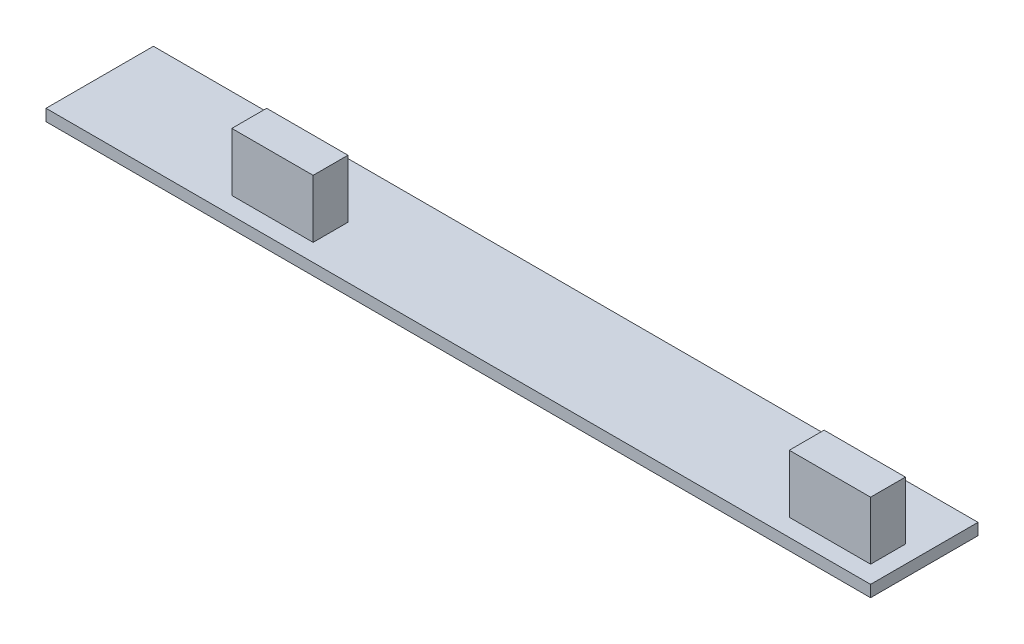
ISO-10303-21;
HEADER;
FILE_DESCRIPTION(('STEP AP214'),'2;1');
FILE_NAME('part.step','',(''),(''),'','','');
FILE_SCHEMA(('AUTOMOTIVE_DESIGN { 1 0 10303 214 1 1 1 1 }'));
ENDSEC;
DATA;
#1=APPLICATION_CONTEXT('core data for automotive mechanical design processes');
#2=APPLICATION_PROTOCOL_DEFINITION('international standard','automotive_design',2000,#1);
#3=PRODUCT_CONTEXT('',#1,'mechanical');
#4=PRODUCT('Part','Part','',(#3));
#5=PRODUCT_RELATED_PRODUCT_CATEGORY('part','',(#4));
#6=PRODUCT_DEFINITION_FORMATION('','',#4);
#7=PRODUCT_DEFINITION_CONTEXT('part definition',#1,'design');
#8=PRODUCT_DEFINITION('design','',#6,#7);
#9=PRODUCT_DEFINITION_SHAPE('','',#8);
#10=(LENGTH_UNIT() NAMED_UNIT(*) SI_UNIT(.MILLI.,.METRE.));
#11=(NAMED_UNIT(*) PLANE_ANGLE_UNIT() SI_UNIT($,.RADIAN.));
#12=(NAMED_UNIT(*) SI_UNIT($,.STERADIAN.) SOLID_ANGLE_UNIT());
#13=UNCERTAINTY_MEASURE_WITH_UNIT(LENGTH_MEASURE(1.E-05),#10,'distance_accuracy_value','');
#14=(GEOMETRIC_REPRESENTATION_CONTEXT(3) GLOBAL_UNCERTAINTY_ASSIGNED_CONTEXT((#13)) GLOBAL_UNIT_ASSIGNED_CONTEXT((#10,
#11,#12)) REPRESENTATION_CONTEXT('',''));
#15=CARTESIAN_POINT('',(0.,0.,0.));
#16=DIRECTION('',(0.,0.,1.));
#17=DIRECTION('',(1.,0.,0.));
#18=AXIS2_PLACEMENT_3D('',#15,#16,#17);
#19=CARTESIAN_POINT('',(259.09224857648,93.3157017452683,38.768969390047));
#20=DIRECTION('',(0.,1.,0.));
#21=DIRECTION('',(0.,0.,1.));
#22=AXIS2_PLACEMENT_3D('',#19,#20,#21);
#23=PLANE('',#22);
#24=DIRECTION('',(0.,0.,-1.));
#25=VECTOR('',#24,1.);
#26=CARTESIAN_POINT('',(320.394917120642,93.3157017452683,109.998911751353));
#27=LINE('',#26,#25);
#28=CARTESIAN_POINT('',(320.394917120642,93.3157017452683,106.998911751353));
#29=VERTEX_POINT('',#28);
#30=CARTESIAN_POINT('',(320.394917120642,93.3157017452683,109.998911751353));
#31=VERTEX_POINT('',#30);
#32=EDGE_CURVE('E103',#29,#31,#27,.F.);
#33=ORIENTED_EDGE('',*,*,#32,.F.);
#34=DIRECTION('',(-1.,0.,0.));
#35=VECTOR('',#34,1.);
#36=CARTESIAN_POINT('',(320.394917120642,93.3157017452683,106.998911751353));
#37=LINE('',#36,#35);
#38=CARTESIAN_POINT('',(313.394917120642,93.3157017452683,106.998911751353));
#39=VERTEX_POINT('',#38);
#40=EDGE_CURVE('E20',#39,#29,#37,.F.);
#41=ORIENTED_EDGE('',*,*,#40,.F.);
#42=DIRECTION('',(0.,0.,1.));
#43=VECTOR('',#42,1.);
#44=CARTESIAN_POINT('',(313.394917120642,93.3157017452683,106.998911751353));
#45=LINE('',#44,#43);
#46=CARTESIAN_POINT('',(313.394917120642,93.3157017452683,109.998911751353));
#47=VERTEX_POINT('',#46);
#48=EDGE_CURVE('E126',#47,#39,#45,.F.);
#49=ORIENTED_EDGE('',*,*,#48,.F.);
#50=DIRECTION('',(1.,0.,0.));
#51=VECTOR('',#50,1.);
#52=CARTESIAN_POINT('',(313.394917120642,93.3157017452683,109.998911751353));
#53=LINE('',#52,#51);
#54=EDGE_CURVE('E119',#31,#47,#53,.F.);
#55=ORIENTED_EDGE('',*,*,#54,.F.);
#56=EDGE_LOOP('',(#33,#41,#49,#55));
#57=FACE_BOUND('',#56,.T.);
#58=ADVANCED_FACE('F17',(#57),#23,.T.);
#59=CARTESIAN_POINT('',(211.09224857648,93.3157017452683,38.768969390047));
#60=DIRECTION('',(0.,1.,0.));
#61=DIRECTION('',(0.,0.,1.));
#62=AXIS2_PLACEMENT_3D('',#59,#60,#61);
#63=PLANE('',#62);
#64=DIRECTION('',(0.,0.,-1.));
#65=VECTOR('',#64,1.);
#66=CARTESIAN_POINT('',(272.394917120642,93.3157017452683,109.998911751353));
#67=LINE('',#66,#65);
#68=CARTESIAN_POINT('',(272.394917120642,93.3157017452683,106.998911751353));
#69=VERTEX_POINT('',#68);
#70=CARTESIAN_POINT('',(272.394917120642,93.3157017452683,109.998911751353));
#71=VERTEX_POINT('',#70);
#72=EDGE_CURVE('E139',#69,#71,#67,.F.);
#73=ORIENTED_EDGE('',*,*,#72,.F.);
#74=DIRECTION('',(-1.,0.,0.));
#75=VECTOR('',#74,1.);
#76=CARTESIAN_POINT('',(272.394917120642,93.3157017452683,106.998911751353));
#77=LINE('',#76,#75);
#78=CARTESIAN_POINT('',(265.394917120642,93.3157017452683,106.998911751353));
#79=VERTEX_POINT('',#78);
#80=EDGE_CURVE('E134',#79,#69,#77,.F.);
#81=ORIENTED_EDGE('',*,*,#80,.F.);
#82=DIRECTION('',(0.,0.,1.));
#83=VECTOR('',#82,1.);
#84=CARTESIAN_POINT('',(265.394917120642,93.3157017452683,106.998911751353));
#85=LINE('',#84,#83);
#86=CARTESIAN_POINT('',(265.394917120642,93.3157017452683,109.998911751353));
#87=VERTEX_POINT('',#86);
#88=EDGE_CURVE('E132',#87,#79,#85,.F.);
#89=ORIENTED_EDGE('',*,*,#88,.F.);
#90=DIRECTION('',(1.,0.,0.));
#91=VECTOR('',#90,1.);
#92=CARTESIAN_POINT('',(265.394917120642,93.3157017452683,109.998911751353));
#93=LINE('',#92,#91);
#94=EDGE_CURVE('E144',#71,#87,#93,.F.);
#95=ORIENTED_EDGE('',*,*,#94,.F.);
#96=EDGE_LOOP('',(#73,#81,#89,#95));
#97=FACE_BOUND('',#96,.T.);
#98=ADVANCED_FACE('F253',(#97),#63,.T.);
#99=CARTESIAN_POINT('',(320.394917120642,93.3157017452683,106.998911751353));
#100=DIRECTION('',(0.,0.,-1.));
#101=DIRECTION('',(-1.,0.,0.));
#102=AXIS2_PLACEMENT_3D('',#99,#100,#101);
#103=PLANE('',#102);
#104=DIRECTION('',(1.,0.,0.));
#105=VECTOR('',#104,1.);
#106=CARTESIAN_POINT('',(627.09224857648,88.3157017452683,106.998911751353));
#107=LINE('',#106,#105);
#108=CARTESIAN_POINT('',(313.394917120642,88.3157017452683,106.998911751353));
#109=VERTEX_POINT('',#108);
#110=CARTESIAN_POINT('',(320.394917120642,88.3157017452683,106.998911751353));
#111=VERTEX_POINT('',#110);
#112=EDGE_CURVE('E151',#109,#111,#107,.T.);
#113=ORIENTED_EDGE('',*,*,#112,.F.);
#114=DIRECTION('',(0.,1.,0.));
#115=VECTOR('',#114,1.);
#116=CARTESIAN_POINT('',(313.394917120642,93.3157017452683,106.998911751353));
#117=LINE('',#116,#115);
#118=EDGE_CURVE('E114',#39,#109,#117,.F.);
#119=ORIENTED_EDGE('',*,*,#118,.F.);
#120=ORIENTED_EDGE('',*,*,#40,.T.);
#121=DIRECTION('',(0.,1.,0.));
#122=VECTOR('',#121,1.);
#123=CARTESIAN_POINT('',(320.394917120642,93.3157017452683,106.998911751353));
#124=LINE('',#123,#122);
#125=EDGE_CURVE('E112',#111,#29,#124,.T.);
#126=ORIENTED_EDGE('',*,*,#125,.F.);
#127=EDGE_LOOP('',(#113,#119,#120,#126));
#128=FACE_BOUND('',#127,.T.);
#129=ADVANCED_FACE('F111',(#128),#103,.T.);
#130=CARTESIAN_POINT('',(320.394917120642,93.3157017452683,109.998911751353));
#131=DIRECTION('',(1.,0.,0.));
#132=DIRECTION('',(0.,0.,-1.));
#133=AXIS2_PLACEMENT_3D('',#130,#131,#132);
#134=PLANE('',#133);
#135=DIRECTION('',(0.,0.,1.));
#136=VECTOR('',#135,1.);
#137=CARTESIAN_POINT('',(320.394917120642,88.3157017452683,38.768969390047));
#138=LINE('',#137,#136);
#139=CARTESIAN_POINT('',(320.394917120642,88.3157017452683,109.998911751353));
#140=VERTEX_POINT('',#139);
#141=EDGE_CURVE('E118',#111,#140,#138,.T.);
#142=ORIENTED_EDGE('',*,*,#141,.F.);
#143=ORIENTED_EDGE('',*,*,#125,.T.);
#144=ORIENTED_EDGE('',*,*,#32,.T.);
#145=DIRECTION('',(0.,1.,0.));
#146=VECTOR('',#145,1.);
#147=CARTESIAN_POINT('',(320.394917120642,93.3157017452683,109.998911751353));
#148=LINE('',#147,#146);
#149=EDGE_CURVE('E124',#140,#31,#148,.T.);
#150=ORIENTED_EDGE('',*,*,#149,.F.);
#151=EDGE_LOOP('',(#142,#143,#144,#150));
#152=FACE_BOUND('',#151,.T.);
#153=ADVANCED_FACE('F117',(#152),#134,.T.);
#154=CARTESIAN_POINT('',(313.394917120642,93.3157017452683,109.998911751353));
#155=DIRECTION('',(0.,0.,1.));
#156=DIRECTION('',(1.,0.,0.));
#157=AXIS2_PLACEMENT_3D('',#154,#155,#156);
#158=PLANE('',#157);
#159=DIRECTION('',(1.,0.,0.));
#160=VECTOR('',#159,1.);
#161=CARTESIAN_POINT('',(627.09224857648,88.3157017452683,109.998911751353));
#162=LINE('',#161,#160);
#163=CARTESIAN_POINT('',(313.394917120642,88.3157017452683,109.998911751353));
#164=VERTEX_POINT('',#163);
#165=EDGE_CURVE('E154',#140,#164,#162,.F.);
#166=ORIENTED_EDGE('',*,*,#165,.F.);
#167=ORIENTED_EDGE('',*,*,#149,.T.);
#168=ORIENTED_EDGE('',*,*,#54,.T.);
#169=DIRECTION('',(0.,1.,0.));
#170=VECTOR('',#169,1.);
#171=CARTESIAN_POINT('',(313.394917120642,93.3157017452683,109.998911751353));
#172=LINE('',#171,#170);
#173=EDGE_CURVE('E129',#164,#47,#172,.T.);
#174=ORIENTED_EDGE('',*,*,#173,.F.);
#175=EDGE_LOOP('',(#166,#167,#168,#174));
#176=FACE_BOUND('',#175,.T.);
#177=ADVANCED_FACE('F245',(#176),#158,.T.);
#178=CARTESIAN_POINT('',(313.394917120642,93.3157017452683,106.998911751353));
#179=DIRECTION('',(-1.,0.,0.));
#180=DIRECTION('',(0.,0.,1.));
#181=AXIS2_PLACEMENT_3D('',#178,#179,#180);
#182=PLANE('',#181);
#183=DIRECTION('',(0.,0.,1.));
#184=VECTOR('',#183,1.);
#185=CARTESIAN_POINT('',(313.394917120642,88.3157017452683,38.768969390047));
#186=LINE('',#185,#184);
#187=EDGE_CURVE('E156',#164,#109,#186,.F.);
#188=ORIENTED_EDGE('',*,*,#187,.F.);
#189=ORIENTED_EDGE('',*,*,#173,.T.);
#190=ORIENTED_EDGE('',*,*,#48,.T.);
#191=ORIENTED_EDGE('',*,*,#118,.T.);
#192=EDGE_LOOP('',(#188,#189,#190,#191));
#193=FACE_BOUND('',#192,.T.);
#194=ADVANCED_FACE('F241',(#193),#182,.T.);
#195=CARTESIAN_POINT('',(265.394917120642,93.3157017452683,106.998911751353));
#196=DIRECTION('',(-1.,0.,0.));
#197=DIRECTION('',(0.,0.,1.));
#198=AXIS2_PLACEMENT_3D('',#195,#196,#197);
#199=PLANE('',#198);
#200=DIRECTION('',(0.,0.,1.));
#201=VECTOR('',#200,1.);
#202=CARTESIAN_POINT('',(265.394917120642,88.3157017452683,38.768969390047));
#203=LINE('',#202,#201);
#204=CARTESIAN_POINT('',(265.394917120642,88.3157017452683,109.998911751353));
#205=VERTEX_POINT('',#204);
#206=CARTESIAN_POINT('',(265.394917120642,88.3157017452683,106.998911751353));
#207=VERTEX_POINT('',#206);
#208=EDGE_CURVE('E159',#205,#207,#203,.F.);
#209=ORIENTED_EDGE('',*,*,#208,.F.);
#210=DIRECTION('',(0.,1.,0.));
#211=VECTOR('',#210,1.);
#212=CARTESIAN_POINT('',(265.394917120642,93.3157017452683,109.998911751353));
#213=LINE('',#212,#211);
#214=EDGE_CURVE('E146',#87,#205,#213,.F.);
#215=ORIENTED_EDGE('',*,*,#214,.F.);
#216=ORIENTED_EDGE('',*,*,#88,.T.);
#217=DIRECTION('',(0.,1.,0.));
#218=VECTOR('',#217,1.);
#219=CARTESIAN_POINT('',(265.394917120642,93.3157017452683,106.998911751353));
#220=LINE('',#219,#218);
#221=EDGE_CURVE('E136',#207,#79,#220,.T.);
#222=ORIENTED_EDGE('',*,*,#221,.F.);
#223=EDGE_LOOP('',(#209,#215,#216,#222));
#224=FACE_BOUND('',#223,.T.);
#225=ADVANCED_FACE('F237',(#224),#199,.T.);
#226=CARTESIAN_POINT('',(272.394917120642,93.3157017452683,106.998911751353));
#227=DIRECTION('',(0.,0.,-1.));
#228=DIRECTION('',(-1.,0.,0.));
#229=AXIS2_PLACEMENT_3D('',#226,#227,#228);
#230=PLANE('',#229);
#231=DIRECTION('',(1.,0.,0.));
#232=VECTOR('',#231,1.);
#233=CARTESIAN_POINT('',(627.09224857648,88.3157017452683,106.998911751353));
#234=LINE('',#233,#232);
#235=CARTESIAN_POINT('',(272.394917120642,88.3157017452683,106.998911751353));
#236=VERTEX_POINT('',#235);
#237=EDGE_CURVE('E161',#207,#236,#234,.T.);
#238=ORIENTED_EDGE('',*,*,#237,.F.);
#239=ORIENTED_EDGE('',*,*,#221,.T.);
#240=ORIENTED_EDGE('',*,*,#80,.T.);
#241=DIRECTION('',(0.,1.,0.));
#242=VECTOR('',#241,1.);
#243=CARTESIAN_POINT('',(272.394917120642,93.3157017452683,106.998911751353));
#244=LINE('',#243,#242);
#245=EDGE_CURVE('E141',#236,#69,#244,.T.);
#246=ORIENTED_EDGE('',*,*,#245,.F.);
#247=EDGE_LOOP('',(#238,#239,#240,#246));
#248=FACE_BOUND('',#247,.T.);
#249=ADVANCED_FACE('F233',(#248),#230,.T.);
#250=CARTESIAN_POINT('',(272.394917120642,93.3157017452683,109.998911751353));
#251=DIRECTION('',(1.,0.,0.));
#252=DIRECTION('',(0.,0.,-1.));
#253=AXIS2_PLACEMENT_3D('',#250,#251,#252);
#254=PLANE('',#253);
#255=DIRECTION('',(0.,0.,1.));
#256=VECTOR('',#255,1.);
#257=CARTESIAN_POINT('',(272.394917120642,88.3157017452683,38.768969390047));
#258=LINE('',#257,#256);
#259=CARTESIAN_POINT('',(272.394917120642,88.3157017452683,109.998911751353));
#260=VERTEX_POINT('',#259);
#261=EDGE_CURVE('E163',#236,#260,#258,.T.);
#262=ORIENTED_EDGE('',*,*,#261,.F.);
#263=ORIENTED_EDGE('',*,*,#245,.T.);
#264=ORIENTED_EDGE('',*,*,#72,.T.);
#265=DIRECTION('',(0.,1.,0.));
#266=VECTOR('',#265,1.);
#267=CARTESIAN_POINT('',(272.394917120642,93.3157017452683,109.998911751353));
#268=LINE('',#267,#266);
#269=EDGE_CURVE('E148',#260,#71,#268,.T.);
#270=ORIENTED_EDGE('',*,*,#269,.F.);
#271=EDGE_LOOP('',(#262,#263,#264,#270));
#272=FACE_BOUND('',#271,.T.);
#273=ADVANCED_FACE('F229',(#272),#254,.T.);
#274=CARTESIAN_POINT('',(265.394917120642,93.3157017452683,109.998911751353));
#275=DIRECTION('',(0.,0.,1.));
#276=DIRECTION('',(1.,0.,0.));
#277=AXIS2_PLACEMENT_3D('',#274,#275,#276);
#278=PLANE('',#277);
#279=DIRECTION('',(1.,0.,0.));
#280=VECTOR('',#279,1.);
#281=CARTESIAN_POINT('',(627.09224857648,88.3157017452683,109.998911751353));
#282=LINE('',#281,#280);
#283=EDGE_CURVE('E165',#260,#205,#282,.F.);
#284=ORIENTED_EDGE('',*,*,#283,.F.);
#285=ORIENTED_EDGE('',*,*,#269,.T.);
#286=ORIENTED_EDGE('',*,*,#94,.T.);
#287=ORIENTED_EDGE('',*,*,#214,.T.);
#288=EDGE_LOOP('',(#284,#285,#286,#287));
#289=FACE_BOUND('',#288,.T.);
#290=ADVANCED_FACE('F225',(#289),#278,.T.);
#291=CARTESIAN_POINT('',(627.09224857648,88.3157017452683,38.768969390047));
#292=DIRECTION('',(0.,1.,0.));
#293=DIRECTION('',(0.,0.,1.));
#294=AXIS2_PLACEMENT_3D('',#291,#292,#293);
#295=PLANE('',#294);
#296=ORIENTED_EDGE('',*,*,#261,.T.);
#297=ORIENTED_EDGE('',*,*,#283,.T.);
#298=ORIENTED_EDGE('',*,*,#208,.T.);
#299=ORIENTED_EDGE('',*,*,#237,.T.);
#300=EDGE_LOOP('',(#296,#297,#298,#299));
#301=FACE_BOUND('',#300,.T.);
#302=ORIENTED_EDGE('',*,*,#165,.T.);
#303=ORIENTED_EDGE('',*,*,#187,.T.);
#304=ORIENTED_EDGE('',*,*,#112,.T.);
#305=ORIENTED_EDGE('',*,*,#141,.T.);
#306=EDGE_LOOP('',(#302,#303,#304,#305));
#307=FACE_BOUND('',#306,.T.);
#308=DIRECTION('',(1.,0.,0.));
#309=VECTOR('',#308,1.);
#310=CARTESIAN_POINT('',(321.894917120642,88.3157017452683,111.498911751353));
#311=LINE('',#310,#309);
#312=CARTESIAN_POINT('',(321.894917120642,88.3157017452683,111.498911751353));
#313=VERTEX_POINT('',#312);
#314=CARTESIAN_POINT('',(250.894917120642,88.3157017452683,111.498911751353));
#315=VERTEX_POINT('',#314);
#316=EDGE_CURVE('E170',#313,#315,#311,.F.);
#317=ORIENTED_EDGE('',*,*,#316,.F.);
#318=DIRECTION('',(0.,0.,-1.));
#319=VECTOR('',#318,1.);
#320=CARTESIAN_POINT('',(321.894917120642,88.3157017452683,81.6867490338913));
#321=LINE('',#320,#319);
#322=CARTESIAN_POINT('',(321.894917120642,88.3157017452683,102.248911751353));
#323=VERTEX_POINT('',#322);
#324=EDGE_CURVE('E174',#323,#313,#321,.F.);
#325=ORIENTED_EDGE('',*,*,#324,.F.);
#326=DIRECTION('',(1.,0.,0.));
#327=VECTOR('',#326,1.);
#328=CARTESIAN_POINT('',(716.961413,88.3157017452683,102.248911751353));
#329=LINE('',#328,#327);
#330=CARTESIAN_POINT('',(250.894917120642,88.3157017452683,102.248911751353));
#331=VERTEX_POINT('',#330);
#332=EDGE_CURVE('E178',#323,#331,#329,.F.);
#333=ORIENTED_EDGE('',*,*,#332,.T.);
#334=DIRECTION('',(0.,0.,1.));
#335=VECTOR('',#334,1.);
#336=CARTESIAN_POINT('',(250.894917120642,88.3157017452683,111.498911751353));
#337=LINE('',#336,#335);
#338=EDGE_CURVE('E168',#315,#331,#337,.F.);
#339=ORIENTED_EDGE('',*,*,#338,.F.);
#340=EDGE_LOOP('',(#317,#325,#333,#339));
#341=FACE_BOUND('',#340,.T.);
#342=ADVANCED_FACE('F222',(#301,#307,#341),#295,.T.);
#343=CARTESIAN_POINT('',(250.894917120642,87.3157017452683,111.498911751353));
#344=DIRECTION('',(-1.,0.,0.));
#345=DIRECTION('',(0.,0.,1.));
#346=AXIS2_PLACEMENT_3D('',#343,#344,#345);
#347=PLANE('',#346);
#348=DIRECTION('',(0.,1.,0.));
#349=VECTOR('',#348,1.);
#350=CARTESIAN_POINT('',(250.894917120642,87.3157017452683,111.498911751353));
#351=LINE('',#350,#349);
#352=CARTESIAN_POINT('',(250.894917120642,87.3157017452683,111.498911751353));
#353=VERTEX_POINT('',#352);
#354=EDGE_CURVE('E172',#315,#353,#351,.F.);
#355=ORIENTED_EDGE('',*,*,#354,.F.);
#356=ORIENTED_EDGE('',*,*,#338,.T.);
#357=DIRECTION('',(0.,1.,0.));
#358=VECTOR('',#357,1.);
#359=CARTESIAN_POINT('',(250.894917120642,86.7156777452683,102.248911751353));
#360=LINE('',#359,#358);
#361=CARTESIAN_POINT('',(250.894917120642,87.3157017452683,102.248911751353));
#362=VERTEX_POINT('',#361);
#363=EDGE_CURVE('E181',#331,#362,#360,.F.);
#364=ORIENTED_EDGE('',*,*,#363,.T.);
#365=DIRECTION('',(0.,0.,1.));
#366=VECTOR('',#365,1.);
#367=CARTESIAN_POINT('',(250.894917120642,87.3157017452683,38.768969390047));
#368=LINE('',#367,#366);
#369=EDGE_CURVE('E185',#362,#353,#368,.T.);
#370=ORIENTED_EDGE('',*,*,#369,.T.);
#371=EDGE_LOOP('',(#355,#356,#364,#370));
#372=FACE_BOUND('',#371,.T.);
#373=ADVANCED_FACE('F205',(#372),#347,.T.);
#374=CARTESIAN_POINT('',(321.894917120642,87.3157017452683,111.498911751353));
#375=DIRECTION('',(0.,0.,1.));
#376=DIRECTION('',(1.,0.,0.));
#377=AXIS2_PLACEMENT_3D('',#374,#375,#376);
#378=PLANE('',#377);
#379=ORIENTED_EDGE('',*,*,#316,.T.);
#380=ORIENTED_EDGE('',*,*,#354,.T.);
#381=DIRECTION('',(1.,0.,0.));
#382=VECTOR('',#381,1.);
#383=CARTESIAN_POINT('',(627.09224857648,87.3157017452683,111.498911751353));
#384=LINE('',#383,#382);
#385=CARTESIAN_POINT('',(321.894917120642,87.3157017452683,111.498911751353));
#386=VERTEX_POINT('',#385);
#387=EDGE_CURVE('E188',#353,#386,#384,.T.);
#388=ORIENTED_EDGE('',*,*,#387,.T.);
#389=DIRECTION('',(0.,1.,0.));
#390=VECTOR('',#389,1.);
#391=CARTESIAN_POINT('',(321.894917120642,87.3157017452683,111.498911751353));
#392=LINE('',#391,#390);
#393=EDGE_CURVE('E176',#313,#386,#392,.F.);
#394=ORIENTED_EDGE('',*,*,#393,.F.);
#395=EDGE_LOOP('',(#379,#380,#388,#394));
#396=FACE_BOUND('',#395,.T.);
#397=ADVANCED_FACE('F200',(#396),#378,.T.);
#398=CARTESIAN_POINT('',(321.894917120642,87.3157017452683,81.6867490338913));
#399=DIRECTION('',(1.,0.,0.));
#400=DIRECTION('',(0.,0.,-1.));
#401=AXIS2_PLACEMENT_3D('',#398,#399,#400);
#402=PLANE('',#401);
#403=ORIENTED_EDGE('',*,*,#393,.T.);
#404=DIRECTION('',(0.,0.,1.));
#405=VECTOR('',#404,1.);
#406=CARTESIAN_POINT('',(321.894917120642,87.3157017452683,38.768969390047));
#407=LINE('',#406,#405);
#408=CARTESIAN_POINT('',(321.894917120642,87.3157017452683,102.248911751353));
#409=VERTEX_POINT('',#408);
#410=EDGE_CURVE('E26',#386,#409,#407,.F.);
#411=ORIENTED_EDGE('',*,*,#410,.T.);
#412=DIRECTION('',(0.,1.,0.));
#413=VECTOR('',#412,1.);
#414=CARTESIAN_POINT('',(321.894917120642,86.7156777452683,102.248911751353));
#415=LINE('',#414,#413);
#416=EDGE_CURVE('E34',#409,#323,#415,.T.);
#417=ORIENTED_EDGE('',*,*,#416,.T.);
#418=ORIENTED_EDGE('',*,*,#324,.T.);
#419=EDGE_LOOP('',(#403,#411,#417,#418));
#420=FACE_BOUND('',#419,.T.);
#421=ADVANCED_FACE('F194',(#420),#402,.T.);
#422=CARTESIAN_POINT('',(716.961413,86.7156777452683,102.248911751353));
#423=DIRECTION('',(0.,0.,1.));
#424=DIRECTION('',(1.,0.,0.));
#425=AXIS2_PLACEMENT_3D('',#422,#423,#424);
#426=PLANE('',#425);
#427=DIRECTION('',(1.,0.,0.));
#428=VECTOR('',#427,1.);
#429=CARTESIAN_POINT('',(627.09224857648,87.3157017452683,102.248911751353));
#430=LINE('',#429,#428);
#431=EDGE_CURVE('E11',#409,#362,#430,.F.);
#432=ORIENTED_EDGE('',*,*,#431,.T.);
#433=ORIENTED_EDGE('',*,*,#363,.F.);
#434=ORIENTED_EDGE('',*,*,#332,.F.);
#435=ORIENTED_EDGE('',*,*,#416,.F.);
#436=EDGE_LOOP('',(#432,#433,#434,#435));
#437=FACE_BOUND('',#436,.T.);
#438=ADVANCED_FACE('F207',(#437),#426,.F.);
#439=CARTESIAN_POINT('',(627.09224857648,87.3157017452683,38.768969390047));
#440=DIRECTION('',(0.,1.,0.));
#441=DIRECTION('',(0.,0.,1.));
#442=AXIS2_PLACEMENT_3D('',#439,#440,#441);
#443=PLANE('',#442);
#444=ORIENTED_EDGE('',*,*,#410,.F.);
#445=ORIENTED_EDGE('',*,*,#387,.F.);
#446=ORIENTED_EDGE('',*,*,#369,.F.);
#447=ORIENTED_EDGE('',*,*,#431,.F.);
#448=EDGE_LOOP('',(#444,#445,#446,#447));
#449=FACE_BOUND('',#448,.T.);
#450=ADVANCED_FACE('F198',(#449),#443,.F.);
#451=CLOSED_SHELL('',(#58,#98,#129,#153,#177,#194,#225,#249,#273,#290,#342,#373,#397,#421,#438,#450));
#452=MANIFOLD_SOLID_BREP('B1',#451);
#453=ADVANCED_BREP_SHAPE_REPRESENTATION('',(#18,#452),#14);
#454=SHAPE_DEFINITION_REPRESENTATION(#9,#453);
ENDSEC;
END-ISO-10303-21;
